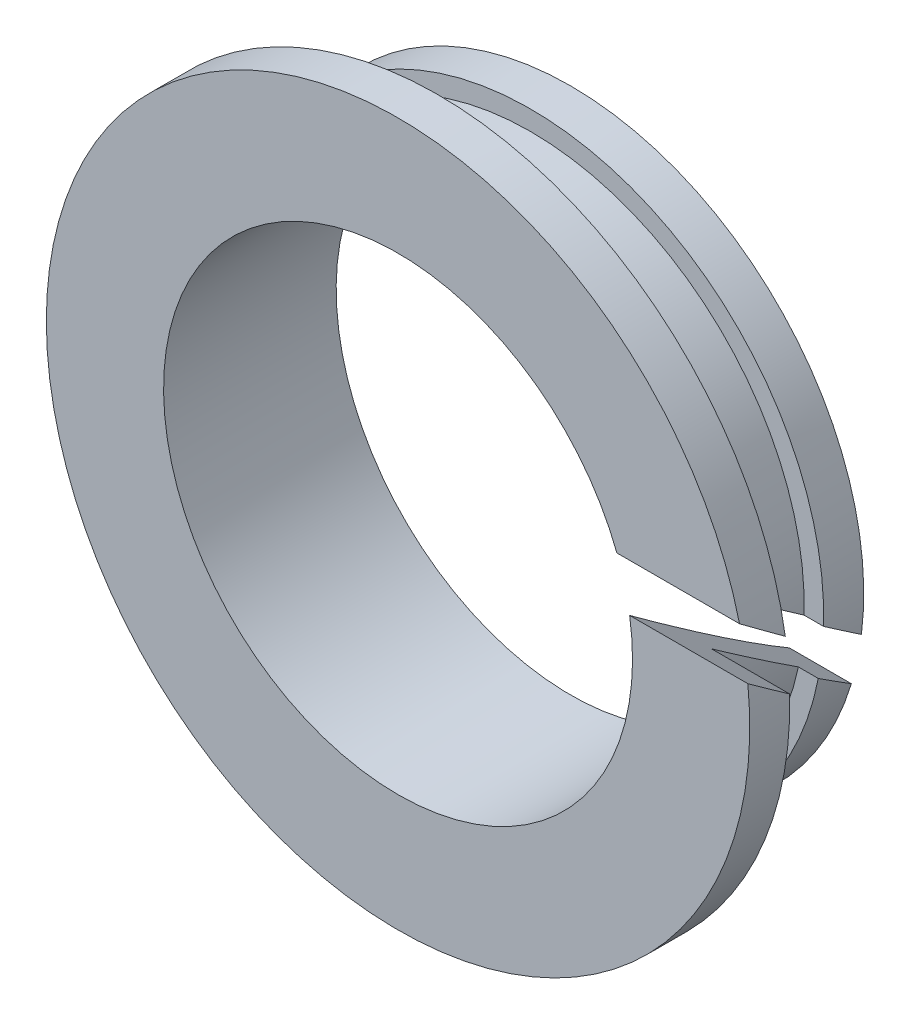
ISO-10303-21;
HEADER;
FILE_DESCRIPTION(('STEP AP214'),'2;1');
FILE_NAME('part.step','',(''),(''),'','','');
FILE_SCHEMA(('AUTOMOTIVE_DESIGN { 1 0 10303 214 1 1 1 1 }'));
ENDSEC;
DATA;
#1=APPLICATION_CONTEXT('core data for automotive mechanical design processes');
#2=APPLICATION_PROTOCOL_DEFINITION('international standard','automotive_design',2000,#1);
#3=PRODUCT_CONTEXT('',#1,'mechanical');
#4=PRODUCT('Part','Part','',(#3));
#5=PRODUCT_RELATED_PRODUCT_CATEGORY('part','',(#4));
#6=PRODUCT_DEFINITION_FORMATION('','',#4);
#7=PRODUCT_DEFINITION_CONTEXT('part definition',#1,'design');
#8=PRODUCT_DEFINITION('design','',#6,#7);
#9=PRODUCT_DEFINITION_SHAPE('','',#8);
#10=(LENGTH_UNIT() NAMED_UNIT(*) SI_UNIT(.MILLI.,.METRE.));
#11=(NAMED_UNIT(*) PLANE_ANGLE_UNIT() SI_UNIT($,.RADIAN.));
#12=(NAMED_UNIT(*) SI_UNIT($,.STERADIAN.) SOLID_ANGLE_UNIT());
#13=UNCERTAINTY_MEASURE_WITH_UNIT(LENGTH_MEASURE(1.E-05),#10,'distance_accuracy_value','');
#14=(GEOMETRIC_REPRESENTATION_CONTEXT(3) GLOBAL_UNCERTAINTY_ASSIGNED_CONTEXT((#13)) GLOBAL_UNIT_ASSIGNED_CONTEXT((#10,
#11,#12)) REPRESENTATION_CONTEXT('',''));
#15=CARTESIAN_POINT('',(0.,0.,0.));
#16=DIRECTION('',(0.,0.,1.));
#17=DIRECTION('',(1.,0.,0.));
#18=AXIS2_PLACEMENT_3D('',#15,#16,#17);
#19=CARTESIAN_POINT('',(0.,0.,0.4064));
#20=DIRECTION('',(0.,0.,1.));
#21=DIRECTION('',(1.,0.,0.));
#22=AXIS2_PLACEMENT_3D('',#19,#20,#21);
#23=CYLINDRICAL_SURFACE('',#22,5.953125);
#24=CARTESIAN_POINT('',(0.,0.,2.44453044681733));
#25=DIRECTION('',(0.,-0.819152044269612,0.573576436378723));
#26=DIRECTION('',(0.,0.573576436378723,0.819152044269612));
#27=AXIS2_PLACEMENT_3D('',#24,#25,#26);
#28=ELLIPSE('',#27,10.378956704681,5.953125);
#29=CARTESIAN_POINT('',(5.70174126712127,-1.71167864636774,0.));
#30=VERTEX_POINT('',#29);
#31=CARTESIAN_POINT('',(5.8424546944069,-1.14254995926996,0.812799999999999));
#32=VERTEX_POINT('',#31);
#33=EDGE_CURVE('E75',#30,#32,#28,.T.);
#34=ORIENTED_EDGE('',*,*,#33,.T.);
#35=CARTESIAN_POINT('',(0.,0.,0.8128));
#36=DIRECTION('',(0.,0.,1.));
#37=DIRECTION('',(1.,0.,0.));
#38=AXIS2_PLACEMENT_3D('',#35,#36,#37);
#39=CIRCLE('',#38,5.953125);
#40=CARTESIAN_POINT('',(5.95059443644931,-0.173560129417629,0.8128));
#41=VERTEX_POINT('',#40);
#42=EDGE_CURVE('E17',#41,#32,#39,.T.);
#43=ORIENTED_EDGE('',*,*,#42,.F.);
#44=CARTESIAN_POINT('',(0.,0.,1.06066955285986));
#45=DIRECTION('',(0.,0.819152044269612,-0.573576436378723));
#46=DIRECTION('',(0.,0.573576436378723,0.819152044269612));
#47=AXIS2_PLACEMENT_3D('',#44,#45,#46);
#48=ELLIPSE('',#47,10.378956704681,5.953125);
#49=CARTESIAN_POINT('',(5.90661583205205,-0.742688816515407,0.));
#50=VERTEX_POINT('',#49);
#51=EDGE_CURVE('E108',#41,#50,#48,.T.);
#52=ORIENTED_EDGE('',*,*,#51,.T.);
#53=CARTESIAN_POINT('',(0.,0.,0.));
#54=DIRECTION('',(0.,0.,1.));
#55=DIRECTION('',(1.,0.,0.));
#56=AXIS2_PLACEMENT_3D('',#53,#54,#55);
#57=CIRCLE('',#56,5.953125);
#58=EDGE_CURVE('E79',#30,#50,#57,.F.);
#59=ORIENTED_EDGE('',*,*,#58,.F.);
#60=EDGE_LOOP('',(#34,#43,#52,#59));
#61=FACE_BOUND('',#60,.T.);
#62=ADVANCED_FACE('F14',(#61),#23,.T.);
#63=CARTESIAN_POINT('',(5.7546875,0.,0.8128));
#64=DIRECTION('',(0.,0.,1.));
#65=DIRECTION('',(1.,0.,0.));
#66=AXIS2_PLACEMENT_3D('',#63,#64,#65);
#67=PLANE('',#66);
#68=CARTESIAN_POINT('',(0.,0.,0.8128));
#69=DIRECTION('',(0.,0.,1.));
#70=DIRECTION('',(1.,0.,0.));
#71=AXIS2_PLACEMENT_3D('',#68,#69,#70);
#72=CIRCLE('',#71,5.55625);
#73=CARTESIAN_POINT('',(5.55353859660456,-0.173560129417628,0.8128));
#74=VERTEX_POINT('',#73);
#75=CARTESIAN_POINT('',(5.43750803705817,-1.14254995926996,0.812799999999999));
#76=VERTEX_POINT('',#75);
#77=EDGE_CURVE('E92',#74,#76,#72,.T.);
#78=ORIENTED_EDGE('',*,*,#77,.F.);
#79=DIRECTION('',(1.,0.,0.));
#80=VECTOR('',#79,1.);
#81=CARTESIAN_POINT('',(3.571875,-0.173560129417629,0.812799999999999));
#82=LINE('',#81,#80);
#83=EDGE_CURVE('E90',#74,#41,#82,.T.);
#84=ORIENTED_EDGE('',*,*,#83,.T.);
#85=ORIENTED_EDGE('',*,*,#42,.T.);
#86=DIRECTION('',(1.,0.,0.));
#87=VECTOR('',#86,1.);
#88=CARTESIAN_POINT('',(3.571875,-1.14254995926996,0.812799999999998));
#89=LINE('',#88,#87);
#90=EDGE_CURVE('E82',#32,#76,#89,.F.);
#91=ORIENTED_EDGE('',*,*,#90,.T.);
#92=EDGE_LOOP('',(#78,#84,#85,#91));
#93=FACE_BOUND('',#92,.T.);
#94=ADVANCED_FACE('F87',(#93),#67,.T.);
#95=CARTESIAN_POINT('',(0.,0.,1.7526));
#96=DIRECTION('',(0.,0.,1.));
#97=DIRECTION('',(1.,0.,0.));
#98=AXIS2_PLACEMENT_3D('',#95,#96,#97);
#99=CYLINDRICAL_SURFACE('',#98,5.55625);
#100=CARTESIAN_POINT('',(0.,0.,2.44453044681733));
#101=DIRECTION('',(0.,-0.819152044269612,0.573576436378723));
#102=DIRECTION('',(0.,0.573576436378723,0.819152044269612));
#103=AXIS2_PLACEMENT_3D('',#100,#101,#102);
#104=ELLIPSE('',#103,9.6870262577023,5.55625);
#105=CARTESIAN_POINT('',(5.5535385965975,0.173560129643656,2.6924));
#106=VERTEX_POINT('',#105);
#107=EDGE_CURVE('E95',#76,#106,#104,.T.);
#108=ORIENTED_EDGE('',*,*,#107,.T.);
#109=CARTESIAN_POINT('',(0.,0.,2.6924));
#110=DIRECTION('',(0.,0.,-1.));
#111=DIRECTION('',(-1.,0.,0.));
#112=AXIS2_PLACEMENT_3D('',#109,#110,#111);
#113=CIRCLE('',#112,5.55625);
#114=CARTESIAN_POINT('',(5.43750803701068,1.14254995949598,2.6924));
#115=VERTEX_POINT('',#114);
#116=EDGE_CURVE('E135',#115,#106,#113,.F.);
#117=ORIENTED_EDGE('',*,*,#116,.F.);
#118=CARTESIAN_POINT('',(0.,0.,1.06066955285986));
#119=DIRECTION('',(0.,0.819152044269612,-0.573576436378723));
#120=DIRECTION('',(0.,0.573576436378723,0.819152044269612));
#121=AXIS2_PLACEMENT_3D('',#118,#119,#120);
#122=ELLIPSE('',#121,9.6870262577023,5.55625);
#123=EDGE_CURVE('E110',#115,#74,#122,.T.);
#124=ORIENTED_EDGE('',*,*,#123,.T.);
#125=ORIENTED_EDGE('',*,*,#77,.T.);
#126=EDGE_LOOP('',(#108,#117,#124,#125));
#127=FACE_BOUND('',#126,.T.);
#128=ADVANCED_FACE('F138',(#127),#99,.T.);
#129=CARTESIAN_POINT('',(6.35,0.,2.6924));
#130=DIRECTION('',(0.,0.,-1.));
#131=DIRECTION('',(-1.,0.,0.));
#132=AXIS2_PLACEMENT_3D('',#129,#130,#131);
#133=PLANE('',#132);
#134=CARTESIAN_POINT('',(0.,0.,2.6924));
#135=DIRECTION('',(0.,0.,1.));
#136=DIRECTION('',(1.,0.,0.));
#137=AXIS2_PLACEMENT_3D('',#134,#135,#136);
#138=CIRCLE('',#137,7.14375);
#139=CARTESIAN_POINT('',(7.05179010270128,1.14254995949598,2.6924));
#140=VERTEX_POINT('',#139);
#141=CARTESIAN_POINT('',(7.14164133402806,0.173560129643655,2.6924));
#142=VERTEX_POINT('',#141);
#143=EDGE_CURVE('E103',#140,#142,#138,.T.);
#144=ORIENTED_EDGE('',*,*,#143,.F.);
#145=DIRECTION('',(1.,0.,0.));
#146=VECTOR('',#145,1.);
#147=CARTESIAN_POINT('',(3.571875,1.14254995949598,2.6924));
#148=LINE('',#147,#146);
#149=EDGE_CURVE('E111',#140,#115,#148,.F.);
#150=ORIENTED_EDGE('',*,*,#149,.T.);
#151=ORIENTED_EDGE('',*,*,#116,.T.);
#152=DIRECTION('',(1.,0.,0.));
#153=VECTOR('',#152,1.);
#154=CARTESIAN_POINT('',(3.571875,0.173560129643655,2.6924));
#155=LINE('',#154,#153);
#156=EDGE_CURVE('E97',#106,#142,#155,.T.);
#157=ORIENTED_EDGE('',*,*,#156,.T.);
#158=EDGE_LOOP('',(#144,#150,#151,#157));
#159=FACE_BOUND('',#158,.T.);
#160=ADVANCED_FACE('F160',(#159),#133,.T.);
#161=CARTESIAN_POINT('',(5.3578125,0.,0.));
#162=DIRECTION('',(0.,0.,-1.));
#163=DIRECTION('',(-1.,0.,0.));
#164=AXIS2_PLACEMENT_3D('',#161,#162,#163);
#165=PLANE('',#164);
#166=DIRECTION('',(1.,0.,0.));
#167=VECTOR('',#166,1.);
#168=CARTESIAN_POINT('',(3.571875,-1.71167864636774,0.));
#169=LINE('',#168,#167);
#170=CARTESIAN_POINT('',(4.44427299584181,-1.71167864636774,0.));
#171=VERTEX_POINT('',#170);
#172=EDGE_CURVE('E83',#171,#30,#169,.T.);
#173=ORIENTED_EDGE('',*,*,#172,.T.);
#174=ORIENTED_EDGE('',*,*,#58,.T.);
#175=DIRECTION('',(1.,0.,0.));
#176=VECTOR('',#175,1.);
#177=CARTESIAN_POINT('',(3.571875,-0.742688816515407,0.));
#178=LINE('',#177,#176);
#179=CARTESIAN_POINT('',(4.7042342173645,-0.742688816515407,0.));
#180=VERTEX_POINT('',#179);
#181=EDGE_CURVE('E104',#50,#180,#178,.F.);
#182=ORIENTED_EDGE('',*,*,#181,.T.);
#183=CARTESIAN_POINT('',(0.,0.,0.));
#184=DIRECTION('',(0.,0.,1.));
#185=DIRECTION('',(1.,0.,0.));
#186=AXIS2_PLACEMENT_3D('',#183,#184,#185);
#187=CIRCLE('',#186,4.7625);
#188=EDGE_CURVE('E120',#180,#171,#187,.T.);
#189=ORIENTED_EDGE('',*,*,#188,.T.);
#190=EDGE_LOOP('',(#173,#174,#182,#189));
#191=FACE_BOUND('',#190,.T.);
#192=ADVANCED_FACE('F145',(#191),#165,.T.);
#193=CARTESIAN_POINT('',(3.571875,-1.6853991571305,-1.34632989378781));
#194=DIRECTION('',(0.,0.819152044269612,-0.573576436378723));
#195=DIRECTION('',(0.,0.573576436378723,0.819152044269612));
#196=AXIS2_PLACEMENT_3D('',#193,#194,#195);
#197=PLANE('',#196);
#198=ORIENTED_EDGE('',*,*,#181,.F.);
#199=ORIENTED_EDGE('',*,*,#51,.F.);
#200=ORIENTED_EDGE('',*,*,#83,.F.);
#201=ORIENTED_EDGE('',*,*,#123,.F.);
#202=ORIENTED_EDGE('',*,*,#149,.F.);
#203=CARTESIAN_POINT('',(0.,0.,1.06066955285986));
#204=DIRECTION('',(0.,0.819152044269612,-0.573576436378723));
#205=DIRECTION('',(0.,0.573576436378723,0.819152044269612));
#206=AXIS2_PLACEMENT_3D('',#203,#204,#205);
#207=ELLIPSE('',#206,12.4547480456172,7.14375);
#208=CARTESIAN_POINT('',(6.93565572049932,1.71167864659376,3.5052));
#209=VERTEX_POINT('',#208);
#210=EDGE_CURVE('E107',#209,#140,#207,.T.);
#211=ORIENTED_EDGE('',*,*,#210,.F.);
#212=DIRECTION('',(1.,0.,0.));
#213=VECTOR('',#212,1.);
#214=CARTESIAN_POINT('',(5.953125,1.71167864659376,3.5052));
#215=LINE('',#214,#213);
#216=CARTESIAN_POINT('',(4.44427299575476,1.71167864659376,3.5052));
#217=VERTEX_POINT('',#216);
#218=EDGE_CURVE('E116',#217,#209,#215,.T.);
#219=ORIENTED_EDGE('',*,*,#218,.F.);
#220=CARTESIAN_POINT('',(0.,0.,1.06066955285986));
#221=DIRECTION('',(0.,0.819152044269612,-0.573576436378723));
#222=DIRECTION('',(0.,0.573576436378723,0.819152044269612));
#223=AXIS2_PLACEMENT_3D('',#220,#221,#222);
#224=ELLIPSE('',#223,8.30316536374483,4.7625);
#225=EDGE_CURVE('E117',#217,#180,#224,.T.);
#226=ORIENTED_EDGE('',*,*,#225,.T.);
#227=EDGE_LOOP('',(#198,#199,#200,#201,#202,#211,#219,#226));
#228=FACE_BOUND('',#227,.T.);
#229=ADVANCED_FACE('F143',(#228),#197,.F.);
#230=CARTESIAN_POINT('',(0.,0.,3.0988));
#231=DIRECTION('',(0.,0.,1.));
#232=DIRECTION('',(1.,0.,0.));
#233=AXIS2_PLACEMENT_3D('',#230,#231,#232);
#234=CYLINDRICAL_SURFACE('',#233,7.14375);
#235=CARTESIAN_POINT('',(0.,0.,2.44453044681733));
#236=DIRECTION('',(0.,-0.819152044269612,0.573576436378723));
#237=DIRECTION('',(0.,0.573576436378723,0.819152044269612));
#238=AXIS2_PLACEMENT_3D('',#235,#236,#237);
#239=ELLIPSE('',#238,12.4547480456172,7.14375);
#240=CARTESIAN_POINT('',(7.10503887279916,0.742688816741433,3.5052));
#241=VERTEX_POINT('',#240);
#242=EDGE_CURVE('E124',#142,#241,#239,.T.);
#243=ORIENTED_EDGE('',*,*,#242,.T.);
#244=CARTESIAN_POINT('',(0.,0.,3.5052));
#245=DIRECTION('',(0.,0.,1.));
#246=DIRECTION('',(1.,0.,0.));
#247=AXIS2_PLACEMENT_3D('',#244,#245,#246);
#248=CIRCLE('',#247,7.14375);
#249=EDGE_CURVE('E114',#209,#241,#248,.T.);
#250=ORIENTED_EDGE('',*,*,#249,.F.);
#251=ORIENTED_EDGE('',*,*,#210,.T.);
#252=ORIENTED_EDGE('',*,*,#143,.T.);
#253=EDGE_LOOP('',(#243,#250,#251,#252));
#254=FACE_BOUND('',#253,.T.);
#255=ADVANCED_FACE('F158',(#254),#234,.T.);
#256=CARTESIAN_POINT('',(3.571875,-2.3356010922695,-0.891053597412195));
#257=DIRECTION('',(0.,-0.819152044269612,0.573576436378723));
#258=DIRECTION('',(0.,-0.573576436378723,-0.819152044269612));
#259=AXIS2_PLACEMENT_3D('',#256,#257,#258);
#260=PLANE('',#259);
#261=DIRECTION('',(1.,0.,0.));
#262=VECTOR('',#261,1.);
#263=CARTESIAN_POINT('',(5.953125,0.742688816741431,3.5052));
#264=LINE('',#263,#262);
#265=CARTESIAN_POINT('',(4.70423421732881,0.742688816741433,3.5052));
#266=VERTEX_POINT('',#265);
#267=EDGE_CURVE('E23',#241,#266,#264,.F.);
#268=ORIENTED_EDGE('',*,*,#267,.F.);
#269=ORIENTED_EDGE('',*,*,#242,.F.);
#270=ORIENTED_EDGE('',*,*,#156,.F.);
#271=ORIENTED_EDGE('',*,*,#107,.F.);
#272=ORIENTED_EDGE('',*,*,#90,.F.);
#273=ORIENTED_EDGE('',*,*,#33,.F.);
#274=ORIENTED_EDGE('',*,*,#172,.F.);
#275=CARTESIAN_POINT('',(0.,0.,2.44453044681733));
#276=DIRECTION('',(0.,-0.819152044269612,0.573576436378723));
#277=DIRECTION('',(0.,0.573576436378723,0.819152044269612));
#278=AXIS2_PLACEMENT_3D('',#275,#276,#277);
#279=ELLIPSE('',#278,8.30316536374483,4.7625);
#280=EDGE_CURVE('E32',#171,#266,#279,.T.);
#281=ORIENTED_EDGE('',*,*,#280,.T.);
#282=EDGE_LOOP('',(#268,#269,#270,#271,#272,#273,#274,#281));
#283=FACE_BOUND('',#282,.T.);
#284=ADVANCED_FACE('F93',(#283),#260,.F.);
#285=CARTESIAN_POINT('',(0.,0.,1.7526));
#286=DIRECTION('',(0.,0.,1.));
#287=DIRECTION('',(1.,0.,0.));
#288=AXIS2_PLACEMENT_3D('',#285,#286,#287);
#289=CYLINDRICAL_SURFACE('',#288,4.7625);
#290=ORIENTED_EDGE('',*,*,#225,.F.);
#291=CARTESIAN_POINT('',(0.,0.,3.5052));
#292=DIRECTION('',(0.,0.,1.));
#293=DIRECTION('',(1.,0.,0.));
#294=AXIS2_PLACEMENT_3D('',#291,#292,#293);
#295=CIRCLE('',#294,4.7625);
#296=EDGE_CURVE('E9',#266,#217,#295,.F.);
#297=ORIENTED_EDGE('',*,*,#296,.F.);
#298=ORIENTED_EDGE('',*,*,#280,.F.);
#299=ORIENTED_EDGE('',*,*,#188,.F.);
#300=EDGE_LOOP('',(#290,#297,#298,#299));
#301=FACE_BOUND('',#300,.T.);
#302=ADVANCED_FACE('F148',(#301),#289,.F.);
#303=CARTESIAN_POINT('',(5.953125,0.,3.5052));
#304=DIRECTION('',(0.,0.,1.));
#305=DIRECTION('',(1.,0.,0.));
#306=AXIS2_PLACEMENT_3D('',#303,#304,#305);
#307=PLANE('',#306);
#308=ORIENTED_EDGE('',*,*,#296,.T.);
#309=ORIENTED_EDGE('',*,*,#218,.T.);
#310=ORIENTED_EDGE('',*,*,#249,.T.);
#311=ORIENTED_EDGE('',*,*,#267,.T.);
#312=EDGE_LOOP('',(#308,#309,#310,#311));
#313=FACE_BOUND('',#312,.T.);
#314=ADVANCED_FACE('F153',(#313),#307,.T.);
#315=CLOSED_SHELL('',(#62,#94,#128,#160,#192,#229,#255,#284,#302,#314));
#316=MANIFOLD_SOLID_BREP('B1',#315);
#317=ADVANCED_BREP_SHAPE_REPRESENTATION('',(#18,#316),#14);
#318=SHAPE_DEFINITION_REPRESENTATION(#9,#317);
ENDSEC;
END-ISO-10303-21;
